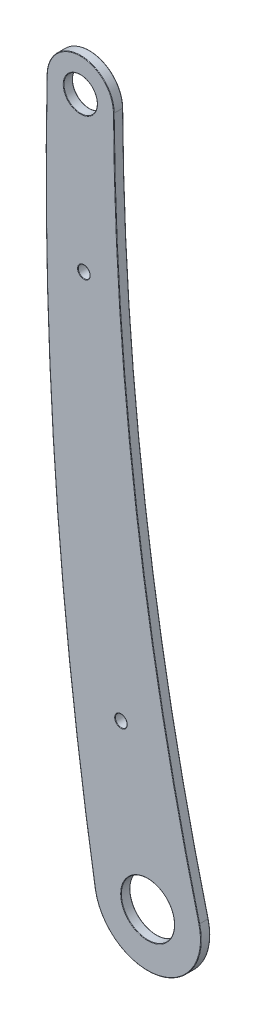
ISO-10303-21;
HEADER;
FILE_DESCRIPTION(('STEP AP214'),'2;1');
FILE_NAME('part.step','',(''),(''),'','','');
FILE_SCHEMA(('AUTOMOTIVE_DESIGN { 1 0 10303 214 1 1 1 1 }'));
ENDSEC;
DATA;
#1=APPLICATION_CONTEXT('core data for automotive mechanical design processes');
#2=APPLICATION_PROTOCOL_DEFINITION('international standard','automotive_design',2000,#1);
#3=PRODUCT_CONTEXT('',#1,'mechanical');
#4=PRODUCT('Part','Part','',(#3));
#5=PRODUCT_RELATED_PRODUCT_CATEGORY('part','',(#4));
#6=PRODUCT_DEFINITION_FORMATION('','',#4);
#7=PRODUCT_DEFINITION_CONTEXT('part definition',#1,'design');
#8=PRODUCT_DEFINITION('design','',#6,#7);
#9=PRODUCT_DEFINITION_SHAPE('','',#8);
#10=(LENGTH_UNIT() NAMED_UNIT(*) SI_UNIT(.MILLI.,.METRE.));
#11=(NAMED_UNIT(*) PLANE_ANGLE_UNIT() SI_UNIT($,.RADIAN.));
#12=(NAMED_UNIT(*) SI_UNIT($,.STERADIAN.) SOLID_ANGLE_UNIT());
#13=UNCERTAINTY_MEASURE_WITH_UNIT(LENGTH_MEASURE(1.E-05),#10,'distance_accuracy_value','');
#14=(GEOMETRIC_REPRESENTATION_CONTEXT(3) GLOBAL_UNCERTAINTY_ASSIGNED_CONTEXT((#13)) GLOBAL_UNIT_ASSIGNED_CONTEXT((#10,
#11,#12)) REPRESENTATION_CONTEXT('',''));
#15=CARTESIAN_POINT('',(0.,0.,0.));
#16=DIRECTION('',(0.,0.,1.));
#17=DIRECTION('',(1.,0.,0.));
#18=AXIS2_PLACEMENT_3D('',#15,#16,#17);
#19=CARTESIAN_POINT('',(-42.3309323896474,278.476144531453,-3.));
#20=DIRECTION('',(0.,0.,1.));
#21=DIRECTION('',(1.,0.,0.));
#22=AXIS2_PLACEMENT_3D('',#19,#20,#21);
#23=CYLINDRICAL_SURFACE('',#22,11.0000000000001);
#24=DIRECTION('',(0.,0.,1.));
#25=VECTOR('',#24,1.);
#26=CARTESIAN_POINT('',(-31.33121526042,278.555031013057,-3.));
#27=LINE('',#26,#25);
#28=CARTESIAN_POINT('',(-31.33121526042,278.555031013057,-2.85));
#29=VERTEX_POINT('',#28);
#30=CARTESIAN_POINT('',(-31.33121526042,278.555031013057,-0.15));
#31=VERTEX_POINT('',#30);
#32=EDGE_CURVE('E105',#29,#31,#27,.T.);
#33=ORIENTED_EDGE('',*,*,#32,.F.);
#34=CARTESIAN_POINT('',(-42.3309323896474,278.476144531453,-2.85));
#35=DIRECTION('',(0.,0.,-1.));
#36=DIRECTION('',(-1.,0.,0.));
#37=AXIS2_PLACEMENT_3D('',#34,#35,#36);
#38=CIRCLE('',#37,11.0000000000001);
#39=CARTESIAN_POINT('',(-53.3279977441943,278.730218512468,-2.85));
#40=VERTEX_POINT('',#39);
#41=EDGE_CURVE('E100',#29,#40,#38,.F.);
#42=ORIENTED_EDGE('',*,*,#41,.T.);
#43=DIRECTION('',(0.,0.,1.));
#44=VECTOR('',#43,1.);
#45=CARTESIAN_POINT('',(-53.3279977441943,278.730218512468,-3.));
#46=LINE('',#45,#44);
#47=CARTESIAN_POINT('',(-53.3279977441943,278.730218512468,-0.15));
#48=VERTEX_POINT('',#47);
#49=EDGE_CURVE('E102',#40,#48,#46,.T.);
#50=ORIENTED_EDGE('',*,*,#49,.T.);
#51=CARTESIAN_POINT('',(-42.3309323896474,278.476144531453,-0.15));
#52=DIRECTION('',(0.,0.,-1.));
#53=DIRECTION('',(-1.,0.,0.));
#54=AXIS2_PLACEMENT_3D('',#51,#52,#53);
#55=CIRCLE('',#54,11.0000000000001);
#56=EDGE_CURVE('E111',#48,#31,#55,.T.);
#57=ORIENTED_EDGE('',*,*,#56,.T.);
#58=EDGE_LOOP('',(#33,#42,#50,#57));
#59=FACE_BOUND('',#58,.T.);
#60=ADVANCED_FACE('F34',(#59),#23,.T.);
#61=CARTESIAN_POINT('',(868.645640767282,285.009379507946,-3.));
#62=DIRECTION('',(0.,0.,1.));
#63=DIRECTION('',(1.,0.,0.));
#64=AXIS2_PLACEMENT_3D('',#61,#62,#63);
#65=CYLINDRICAL_SURFACE('',#64,900.);
#66=DIRECTION('',(0.,0.,1.));
#67=VECTOR('',#66,1.);
#68=CARTESIAN_POINT('',(-3.26615944040631,61.9178900723588,-3.));
#69=LINE('',#68,#67);
#70=CARTESIAN_POINT('',(-3.26615944040631,61.9178900723588,-2.85));
#71=VERTEX_POINT('',#70);
#72=CARTESIAN_POINT('',(-3.26615944040631,61.9178900723588,-0.15));
#73=VERTEX_POINT('',#72);
#74=EDGE_CURVE('E235',#71,#73,#69,.T.);
#75=ORIENTED_EDGE('',*,*,#74,.F.);
#76=CARTESIAN_POINT('',(868.645640767282,285.009379507946,-2.85));
#77=DIRECTION('',(0.,0.,-1.));
#78=DIRECTION('',(-1.,0.,0.));
#79=AXIS2_PLACEMENT_3D('',#76,#77,#78);
#80=CIRCLE('',#79,900.);
#81=EDGE_CURVE('E167',#71,#29,#80,.T.);
#82=ORIENTED_EDGE('',*,*,#81,.T.);
#83=ORIENTED_EDGE('',*,*,#32,.T.);
#84=CARTESIAN_POINT('',(868.645640767282,285.009379507946,-0.15));
#85=DIRECTION('',(0.,0.,-1.));
#86=DIRECTION('',(-1.,0.,0.));
#87=AXIS2_PLACEMENT_3D('',#84,#85,#86);
#88=CIRCLE('',#87,900.);
#89=EDGE_CURVE('E164',#31,#73,#88,.F.);
#90=ORIENTED_EDGE('',*,*,#89,.T.);
#91=EDGE_LOOP('',(#75,#82,#83,#90));
#92=FACE_BOUND('',#91,.T.);
#93=ADVANCED_FACE('F232',(#92),#65,.F.);
#94=CARTESIAN_POINT('',(-20.2199999999997,57.58,-3.));
#95=DIRECTION('',(0.,0.,1.));
#96=DIRECTION('',(1.,0.,0.));
#97=AXIS2_PLACEMENT_3D('',#94,#95,#96);
#98=CYLINDRICAL_SURFACE('',#97,17.4999999999997);
#99=DIRECTION('',(0.,0.,1.));
#100=VECTOR('',#99,1.);
#101=CARTESIAN_POINT('',(-37.4842769847946,54.7173543369338,-3.));
#102=LINE('',#101,#100);
#103=CARTESIAN_POINT('',(-37.4842769847946,54.7173543369338,-2.85));
#104=VERTEX_POINT('',#103);
#105=CARTESIAN_POINT('',(-37.4842769847946,54.7173543369338,-0.15));
#106=VERTEX_POINT('',#105);
#107=EDGE_CURVE('E122',#104,#106,#102,.T.);
#108=ORIENTED_EDGE('',*,*,#107,.F.);
#109=CARTESIAN_POINT('',(-20.2199999999997,57.58,-2.85));
#110=DIRECTION('',(0.,0.,-1.));
#111=DIRECTION('',(-1.,0.,0.));
#112=AXIS2_PLACEMENT_3D('',#109,#110,#111);
#113=CIRCLE('',#112,17.4999999999997);
#114=EDGE_CURVE('E162',#104,#71,#113,.F.);
#115=ORIENTED_EDGE('',*,*,#114,.T.);
#116=ORIENTED_EDGE('',*,*,#74,.T.);
#117=CARTESIAN_POINT('',(-20.2199999999997,57.58,-0.15));
#118=DIRECTION('',(0.,0.,-1.));
#119=DIRECTION('',(-1.,0.,0.));
#120=AXIS2_PLACEMENT_3D('',#117,#118,#119);
#121=CIRCLE('',#120,17.4999999999997);
#122=EDGE_CURVE('E160',#73,#106,#121,.T.);
#123=ORIENTED_EDGE('',*,*,#122,.T.);
#124=EDGE_LOOP('',(#108,#115,#116,#123));
#125=FACE_BOUND('',#124,.T.);
#126=ADVANCED_FACE('F279',(#125),#98,.T.);
#127=CARTESIAN_POINT('',(1146.35185911544,251.013056947191,-3.));
#128=DIRECTION('',(0.,0.,1.));
#129=DIRECTION('',(1.,0.,0.));
#130=AXIS2_PLACEMENT_3D('',#127,#128,#129);
#131=CYLINDRICAL_SURFACE('',#130,1200.);
#132=ORIENTED_EDGE('',*,*,#49,.F.);
#133=CARTESIAN_POINT('',(1146.35185911544,251.013056947191,-2.85));
#134=DIRECTION('',(0.,0.,-1.));
#135=DIRECTION('',(-1.,0.,0.));
#136=AXIS2_PLACEMENT_3D('',#133,#134,#135);
#137=CIRCLE('',#136,1200.);
#138=EDGE_CURVE('E118',#40,#104,#137,.F.);
#139=ORIENTED_EDGE('',*,*,#138,.T.);
#140=ORIENTED_EDGE('',*,*,#107,.T.);
#141=CARTESIAN_POINT('',(1146.35185911544,251.013056947191,-0.15));
#142=DIRECTION('',(0.,0.,-1.));
#143=DIRECTION('',(-1.,0.,0.));
#144=AXIS2_PLACEMENT_3D('',#141,#142,#143);
#145=CIRCLE('',#144,1200.);
#146=EDGE_CURVE('E121',#106,#48,#145,.T.);
#147=ORIENTED_EDGE('',*,*,#146,.T.);
#148=EDGE_LOOP('',(#132,#139,#140,#147));
#149=FACE_BOUND('',#148,.T.);
#150=ADVANCED_FACE('F115',(#149),#131,.T.);
#151=CARTESIAN_POINT('',(413.157354188817,281.7427620197,-3.));
#152=DIRECTION('',(0.,0.,-1.));
#153=DIRECTION('',(-1.,0.,0.));
#154=AXIS2_PLACEMENT_3D('',#151,#152,#153);
#155=PLANE('',#154);
#156=CARTESIAN_POINT('',(-20.2199999999997,57.58,-3.));
#157=DIRECTION('',(0.,0.,-1.));
#158=DIRECTION('',(-1.,0.,0.));
#159=AXIS2_PLACEMENT_3D('',#156,#157,#158);
#160=CIRCLE('',#159,17.3499999999997);
#161=CARTESIAN_POINT('',(-3.41147807377414,61.8807081574529,-3.));
#162=VERTEX_POINT('',#161);
#163=CARTESIAN_POINT('',(-37.336297467782,54.7418912997601,-3.));
#164=VERTEX_POINT('',#163);
#165=EDGE_CURVE('E156',#162,#164,#160,.T.);
#166=ORIENTED_EDGE('',*,*,#165,.T.);
#167=CARTESIAN_POINT('',(1146.35185911544,251.013056947191,-3.));
#168=DIRECTION('',(0.,0.,-1.));
#169=DIRECTION('',(-1.,0.,0.));
#170=AXIS2_PLACEMENT_3D('',#167,#168,#169);
#171=CIRCLE('',#170,1199.85);
#172=CARTESIAN_POINT('',(-53.1780377620867,278.726753867272,-3.));
#173=VERTEX_POINT('',#172);
#174=EDGE_CURVE('E158',#164,#173,#171,.T.);
#175=ORIENTED_EDGE('',*,*,#174,.T.);
#176=CARTESIAN_POINT('',(-42.3309323896474,278.476144531453,-3.));
#177=DIRECTION('',(0.,0.,-1.));
#178=DIRECTION('',(-1.,0.,0.));
#179=AXIS2_PLACEMENT_3D('',#176,#177,#178);
#180=CIRCLE('',#179,10.8500000000001);
#181=CARTESIAN_POINT('',(-31.481211403091,278.553955288308,-3.));
#182=VERTEX_POINT('',#181);
#183=EDGE_CURVE('E128',#173,#182,#180,.T.);
#184=ORIENTED_EDGE('',*,*,#183,.T.);
#185=CARTESIAN_POINT('',(868.645640767282,285.009379507946,-3.));
#186=DIRECTION('',(0.,0.,-1.));
#187=DIRECTION('',(-1.,0.,0.));
#188=AXIS2_PLACEMENT_3D('',#185,#186,#187);
#189=CIRCLE('',#188,900.15);
#190=EDGE_CURVE('E154',#182,#162,#189,.F.);
#191=ORIENTED_EDGE('',*,*,#190,.T.);
#192=EDGE_LOOP('',(#166,#175,#184,#191));
#193=FACE_BOUND('',#192,.T.);
#194=CARTESIAN_POINT('',(-20.2199999999997,57.58,-3.));
#195=DIRECTION('',(0.,0.,-1.));
#196=DIRECTION('',(-1.,0.,0.));
#197=AXIS2_PLACEMENT_3D('',#194,#195,#196);
#198=CIRCLE('',#197,8.9);
#199=CARTESIAN_POINT('',(-29.1199999999997,57.58,-3.));
#200=VERTEX_POINT('',#199);
#201=EDGE_CURVE('E150',#200,#200,#198,.F.);
#202=ORIENTED_EDGE('',*,*,#201,.T.);
#203=EDGE_LOOP('',(#202));
#204=FACE_BOUND('',#203,.T.);
#205=CARTESIAN_POINT('',(-42.3309323896474,278.476144531453,-3.));
#206=DIRECTION('',(0.,0.,-1.));
#207=DIRECTION('',(-1.,0.,0.));
#208=AXIS2_PLACEMENT_3D('',#205,#206,#207);
#209=CIRCLE('',#208,5.65);
#210=CARTESIAN_POINT('',(-47.9809323896473,278.476144531453,-3.));
#211=VERTEX_POINT('',#210);
#212=EDGE_CURVE('E147',#211,#211,#209,.F.);
#213=ORIENTED_EDGE('',*,*,#212,.T.);
#214=EDGE_LOOP('',(#213));
#215=FACE_BOUND('',#214,.T.);
#216=CARTESIAN_POINT('',(-28.9927348903585,106.804375288504,-3.));
#217=DIRECTION('',(0.,0.,-1.));
#218=DIRECTION('',(-1.,0.,0.));
#219=AXIS2_PLACEMENT_3D('',#216,#217,#218);
#220=CIRCLE('',#219,2.1);
#221=CARTESIAN_POINT('',(-31.0927348903585,106.804375288504,-3.));
#222=VERTEX_POINT('',#221);
#223=EDGE_CURVE('E141',#222,#222,#220,.F.);
#224=ORIENTED_EDGE('',*,*,#223,.T.);
#225=EDGE_LOOP('',(#224));
#226=FACE_BOUND('',#225,.T.);
#227=CARTESIAN_POINT('',(-41.1729962338893,228.489554491131,-3.));
#228=DIRECTION('',(0.,0.,-1.));
#229=DIRECTION('',(-1.,0.,0.));
#230=AXIS2_PLACEMENT_3D('',#227,#228,#229);
#231=CIRCLE('',#230,2.1);
#232=CARTESIAN_POINT('',(-43.2729962338893,228.489554491131,-3.));
#233=VERTEX_POINT('',#232);
#234=EDGE_CURVE('E138',#233,#233,#231,.F.);
#235=ORIENTED_EDGE('',*,*,#234,.T.);
#236=EDGE_LOOP('',(#235));
#237=FACE_BOUND('',#236,.T.);
#238=ADVANCED_FACE('F244',(#193,#204,#215,#226,#237),#155,.T.);
#239=CARTESIAN_POINT('',(413.157354188817,281.7427620197,0.));
#240=DIRECTION('',(0.,0.,-1.));
#241=DIRECTION('',(-1.,0.,0.));
#242=AXIS2_PLACEMENT_3D('',#239,#240,#241);
#243=PLANE('',#242);
#244=CARTESIAN_POINT('',(-20.2199999999997,57.58,0.));
#245=DIRECTION('',(0.,0.,-1.));
#246=DIRECTION('',(-1.,0.,0.));
#247=AXIS2_PLACEMENT_3D('',#244,#245,#246);
#248=CIRCLE('',#247,17.3499999999997);
#249=CARTESIAN_POINT('',(-37.3362974677822,54.74189129976,0.));
#250=VERTEX_POINT('',#249);
#251=CARTESIAN_POINT('',(-3.41147807377414,61.8807081574529,0.));
#252=VERTEX_POINT('',#251);
#253=EDGE_CURVE('E43',#250,#252,#248,.F.);
#254=ORIENTED_EDGE('',*,*,#253,.T.);
#255=CARTESIAN_POINT('',(868.645640767282,285.009379507946,0.));
#256=DIRECTION('',(0.,0.,-1.));
#257=DIRECTION('',(-1.,0.,0.));
#258=AXIS2_PLACEMENT_3D('',#255,#256,#257);
#259=CIRCLE('',#258,900.15);
#260=CARTESIAN_POINT('',(-31.481211403091,278.553955288308,0.));
#261=VERTEX_POINT('',#260);
#262=EDGE_CURVE('E11',#252,#261,#259,.T.);
#263=ORIENTED_EDGE('',*,*,#262,.T.);
#264=CARTESIAN_POINT('',(-42.3309323896474,278.476144531453,0.));
#265=DIRECTION('',(0.,0.,-1.));
#266=DIRECTION('',(-1.,0.,0.));
#267=AXIS2_PLACEMENT_3D('',#264,#265,#266);
#268=CIRCLE('',#267,10.8500000000001);
#269=CARTESIAN_POINT('',(-53.1780377620867,278.726753867272,0.));
#270=VERTEX_POINT('',#269);
#271=EDGE_CURVE('E205',#261,#270,#268,.F.);
#272=ORIENTED_EDGE('',*,*,#271,.T.);
#273=CARTESIAN_POINT('',(1146.35185911544,251.013056947191,0.));
#274=DIRECTION('',(0.,0.,-1.));
#275=DIRECTION('',(-1.,0.,0.));
#276=AXIS2_PLACEMENT_3D('',#273,#274,#275);
#277=CIRCLE('',#276,1199.85);
#278=EDGE_CURVE('E54',#270,#250,#277,.F.);
#279=ORIENTED_EDGE('',*,*,#278,.T.);
#280=EDGE_LOOP('',(#254,#263,#272,#279));
#281=FACE_BOUND('',#280,.T.);
#282=CARTESIAN_POINT('',(-20.2199999999997,57.58,0.));
#283=DIRECTION('',(0.,0.,-1.));
#284=DIRECTION('',(-1.,0.,0.));
#285=AXIS2_PLACEMENT_3D('',#282,#283,#284);
#286=CIRCLE('',#285,8.9);
#287=CARTESIAN_POINT('',(-29.1199999999997,57.58,0.));
#288=VERTEX_POINT('',#287);
#289=EDGE_CURVE('E202',#288,#288,#286,.T.);
#290=ORIENTED_EDGE('',*,*,#289,.T.);
#291=EDGE_LOOP('',(#290));
#292=FACE_BOUND('',#291,.T.);
#293=CARTESIAN_POINT('',(-42.3309323896474,278.476144531453,0.));
#294=DIRECTION('',(0.,0.,-1.));
#295=DIRECTION('',(-1.,0.,0.));
#296=AXIS2_PLACEMENT_3D('',#293,#294,#295);
#297=CIRCLE('',#296,5.65);
#298=CARTESIAN_POINT('',(-47.9809323896473,278.476144531453,0.));
#299=VERTEX_POINT('',#298);
#300=EDGE_CURVE('E199',#299,#299,#297,.T.);
#301=ORIENTED_EDGE('',*,*,#300,.T.);
#302=EDGE_LOOP('',(#301));
#303=FACE_BOUND('',#302,.T.);
#304=CARTESIAN_POINT('',(-28.9927348903585,106.804375288504,0.));
#305=DIRECTION('',(0.,0.,-1.));
#306=DIRECTION('',(-1.,0.,0.));
#307=AXIS2_PLACEMENT_3D('',#304,#305,#306);
#308=CIRCLE('',#307,2.1);
#309=CARTESIAN_POINT('',(-31.0927348903585,106.804375288504,0.));
#310=VERTEX_POINT('',#309);
#311=EDGE_CURVE('E196',#310,#310,#308,.T.);
#312=ORIENTED_EDGE('',*,*,#311,.T.);
#313=EDGE_LOOP('',(#312));
#314=FACE_BOUND('',#313,.T.);
#315=CARTESIAN_POINT('',(-41.1729962338893,228.489554491131,0.));
#316=DIRECTION('',(0.,0.,-1.));
#317=DIRECTION('',(-1.,0.,0.));
#318=AXIS2_PLACEMENT_3D('',#315,#316,#317);
#319=CIRCLE('',#318,2.1);
#320=CARTESIAN_POINT('',(-43.2729962338893,228.489554491131,0.));
#321=VERTEX_POINT('',#320);
#322=EDGE_CURVE('E193',#321,#321,#319,.T.);
#323=ORIENTED_EDGE('',*,*,#322,.T.);
#324=EDGE_LOOP('',(#323));
#325=FACE_BOUND('',#324,.T.);
#326=ADVANCED_FACE('F240',(#281,#292,#303,#314,#325),#243,.F.);
#327=CARTESIAN_POINT('',(-20.2199999999997,57.58,-3.));
#328=DIRECTION('',(0.,0.,1.));
#329=DIRECTION('',(1.,0.,0.));
#330=AXIS2_PLACEMENT_3D('',#327,#328,#329);
#331=CYLINDRICAL_SURFACE('',#330,8.75);
#332=CARTESIAN_POINT('',(-20.2199999999997,57.58,-2.85));
#333=DIRECTION('',(0.,0.,-1.));
#334=DIRECTION('',(-1.,0.,0.));
#335=AXIS2_PLACEMENT_3D('',#332,#333,#334);
#336=CIRCLE('',#335,8.75);
#337=CARTESIAN_POINT('',(-28.9699999999997,57.58,-2.85));
#338=VERTEX_POINT('',#337);
#339=EDGE_CURVE('E172',#338,#338,#336,.T.);
#340=ORIENTED_EDGE('',*,*,#339,.T.);
#341=EDGE_LOOP('',(#340));
#342=FACE_BOUND('',#341,.T.);
#343=CARTESIAN_POINT('',(-20.2199999999997,57.58,-0.15));
#344=DIRECTION('',(0.,0.,-1.));
#345=DIRECTION('',(-1.,0.,0.));
#346=AXIS2_PLACEMENT_3D('',#343,#344,#345);
#347=CIRCLE('',#346,8.75);
#348=CARTESIAN_POINT('',(-28.9699999999997,57.58,-0.15));
#349=VERTEX_POINT('',#348);
#350=EDGE_CURVE('E110',#349,#349,#347,.F.);
#351=ORIENTED_EDGE('',*,*,#350,.T.);
#352=EDGE_LOOP('',(#351));
#353=FACE_BOUND('',#352,.T.);
#354=ADVANCED_FACE('F243',(#342,#353),#331,.F.);
#355=CARTESIAN_POINT('',(-42.3309323896474,278.476144531453,-3.));
#356=DIRECTION('',(0.,0.,1.));
#357=DIRECTION('',(1.,0.,0.));
#358=AXIS2_PLACEMENT_3D('',#355,#356,#357);
#359=CYLINDRICAL_SURFACE('',#358,5.5);
#360=CARTESIAN_POINT('',(-42.3309323896474,278.476144531453,-2.85));
#361=DIRECTION('',(0.,0.,-1.));
#362=DIRECTION('',(-1.,0.,0.));
#363=AXIS2_PLACEMENT_3D('',#360,#361,#362);
#364=CIRCLE('',#363,5.5);
#365=CARTESIAN_POINT('',(-47.8309323896474,278.476144531453,-2.85));
#366=VERTEX_POINT('',#365);
#367=EDGE_CURVE('E178',#366,#366,#364,.T.);
#368=ORIENTED_EDGE('',*,*,#367,.T.);
#369=EDGE_LOOP('',(#368));
#370=FACE_BOUND('',#369,.T.);
#371=CARTESIAN_POINT('',(-42.3309323896474,278.476144531453,-0.15));
#372=DIRECTION('',(0.,0.,-1.));
#373=DIRECTION('',(-1.,0.,0.));
#374=AXIS2_PLACEMENT_3D('',#371,#372,#373);
#375=CIRCLE('',#374,5.5);
#376=CARTESIAN_POINT('',(-47.8309323896474,278.476144531453,-0.15));
#377=VERTEX_POINT('',#376);
#378=EDGE_CURVE('E175',#377,#377,#375,.F.);
#379=ORIENTED_EDGE('',*,*,#378,.T.);
#380=EDGE_LOOP('',(#379));
#381=FACE_BOUND('',#380,.T.);
#382=ADVANCED_FACE('F271',(#370,#381),#359,.F.);
#383=CARTESIAN_POINT('',(-28.9927348903585,106.804375288504,-3.));
#384=DIRECTION('',(0.,0.,1.));
#385=DIRECTION('',(1.,0.,0.));
#386=AXIS2_PLACEMENT_3D('',#383,#384,#385);
#387=CYLINDRICAL_SURFACE('',#386,1.95);
#388=CARTESIAN_POINT('',(-28.9927348903585,106.804375288504,-2.85));
#389=DIRECTION('',(0.,0.,-1.));
#390=DIRECTION('',(-1.,0.,0.));
#391=AXIS2_PLACEMENT_3D('',#388,#389,#390);
#392=CIRCLE('',#391,1.95);
#393=CARTESIAN_POINT('',(-30.9427348903585,106.804375288504,-2.85));
#394=VERTEX_POINT('',#393);
#395=EDGE_CURVE('E184',#394,#394,#392,.T.);
#396=ORIENTED_EDGE('',*,*,#395,.T.);
#397=EDGE_LOOP('',(#396));
#398=FACE_BOUND('',#397,.T.);
#399=CARTESIAN_POINT('',(-28.9927348903585,106.804375288504,-0.15));
#400=DIRECTION('',(0.,0.,-1.));
#401=DIRECTION('',(-1.,0.,0.));
#402=AXIS2_PLACEMENT_3D('',#399,#400,#401);
#403=CIRCLE('',#402,1.95);
#404=CARTESIAN_POINT('',(-30.9427348903585,106.804375288504,-0.15));
#405=VERTEX_POINT('',#404);
#406=EDGE_CURVE('E181',#405,#405,#403,.F.);
#407=ORIENTED_EDGE('',*,*,#406,.T.);
#408=EDGE_LOOP('',(#407));
#409=FACE_BOUND('',#408,.T.);
#410=ADVANCED_FACE('F262',(#398,#409),#387,.F.);
#411=CARTESIAN_POINT('',(-41.1729962338893,228.489554491131,-3.));
#412=DIRECTION('',(0.,0.,1.));
#413=DIRECTION('',(1.,0.,0.));
#414=AXIS2_PLACEMENT_3D('',#411,#412,#413);
#415=CYLINDRICAL_SURFACE('',#414,1.95);
#416=CARTESIAN_POINT('',(-41.1729962338893,228.489554491131,-2.85));
#417=DIRECTION('',(0.,0.,-1.));
#418=DIRECTION('',(-1.,0.,0.));
#419=AXIS2_PLACEMENT_3D('',#416,#417,#418);
#420=CIRCLE('',#419,1.95);
#421=CARTESIAN_POINT('',(-43.1229962338893,228.489554491131,-2.85));
#422=VERTEX_POINT('',#421);
#423=EDGE_CURVE('E190',#422,#422,#420,.T.);
#424=ORIENTED_EDGE('',*,*,#423,.T.);
#425=EDGE_LOOP('',(#424));
#426=FACE_BOUND('',#425,.T.);
#427=CARTESIAN_POINT('',(-41.1729962338893,228.489554491131,-0.15));
#428=DIRECTION('',(0.,0.,-1.));
#429=DIRECTION('',(-1.,0.,0.));
#430=AXIS2_PLACEMENT_3D('',#427,#428,#429);
#431=CIRCLE('',#430,1.95);
#432=CARTESIAN_POINT('',(-43.1229962338893,228.489554491131,-0.15));
#433=VERTEX_POINT('',#432);
#434=EDGE_CURVE('E187',#433,#433,#431,.F.);
#435=ORIENTED_EDGE('',*,*,#434,.T.);
#436=EDGE_LOOP('',(#435));
#437=FACE_BOUND('',#436,.T.);
#438=ADVANCED_FACE('F259',(#426,#437),#415,.F.);
#439=CARTESIAN_POINT('',(868.645640767282,285.009379507946,-2.85));
#440=DIRECTION('',(0.,0.,-1.));
#441=DIRECTION('',(-1.,0.,0.));
#442=AXIS2_PLACEMENT_3D('',#439,#440,#441);
#443=TOROIDAL_SURFACE('',#442,900.15,0.15);
#444=CARTESIAN_POINT('',(-3.41147807377414,61.8807081574529,-2.85));
#445=DIRECTION('',(0.24787943270622,-0.96879088911965,0.));
#446=DIRECTION('',(0.96879088911965,0.24787943270622,0.));
#447=AXIS2_PLACEMENT_3D('',#444,#445,#446);
#448=CIRCLE('',#447,0.15);
#449=EDGE_CURVE('E132',#162,#71,#448,.T.);
#450=ORIENTED_EDGE('',*,*,#449,.F.);
#451=ORIENTED_EDGE('',*,*,#190,.F.);
#452=CARTESIAN_POINT('',(-31.4812114030913,278.553955288308,-2.85));
#453=DIRECTION('',(-0.00717149832777743,0.999974284475223,0.));
#454=DIRECTION('',(-0.999974284475223,-0.00717149832777743,0.));
#455=AXIS2_PLACEMENT_3D('',#452,#453,#454);
#456=CIRCLE('',#455,0.15);
#457=EDGE_CURVE('E123',#29,#182,#456,.T.);
#458=ORIENTED_EDGE('',*,*,#457,.F.);
#459=ORIENTED_EDGE('',*,*,#81,.F.);
#460=EDGE_LOOP('',(#450,#451,#458,#459));
#461=FACE_BOUND('',#460,.T.);
#462=ADVANCED_FACE('F261',(#461),#443,.T.);
#463=CARTESIAN_POINT('',(-42.3309323896474,278.476144531453,-2.85));
#464=DIRECTION('',(0.,0.,-1.));
#465=DIRECTION('',(-1.,0.,0.));
#466=AXIS2_PLACEMENT_3D('',#463,#464,#465);
#467=TOROIDAL_SURFACE('',#466,10.8500000000001,0.15);
#468=ORIENTED_EDGE('',*,*,#457,.T.);
#469=ORIENTED_EDGE('',*,*,#183,.F.);
#470=CARTESIAN_POINT('',(-53.1780377620867,278.726753867272,-2.85));
#471=DIRECTION('',(-0.023097634637888,-0.999733214049696,0.));
#472=DIRECTION('',(0.999733214049696,-0.023097634637888,0.));
#473=AXIS2_PLACEMENT_3D('',#470,#471,#472);
#474=CIRCLE('',#473,0.15);
#475=EDGE_CURVE('E126',#40,#173,#474,.T.);
#476=ORIENTED_EDGE('',*,*,#475,.F.);
#477=ORIENTED_EDGE('',*,*,#41,.F.);
#478=EDGE_LOOP('',(#468,#469,#476,#477));
#479=FACE_BOUND('',#478,.T.);
#480=ADVANCED_FACE('F127',(#479),#467,.T.);
#481=CARTESIAN_POINT('',(-20.2199999999997,57.58,-2.85));
#482=DIRECTION('',(0.,0.,-1.));
#483=DIRECTION('',(-1.,0.,0.));
#484=AXIS2_PLACEMENT_3D('',#481,#482,#483);
#485=TOROIDAL_SURFACE('',#484,17.3499999999997,0.15);
#486=ORIENTED_EDGE('',*,*,#449,.T.);
#487=ORIENTED_EDGE('',*,*,#114,.F.);
#488=CARTESIAN_POINT('',(-37.336297467782,54.7418912997601,-2.85));
#489=DIRECTION('',(-0.163579752175218,0.986530113416866,0.));
#490=DIRECTION('',(-0.986530113416866,-0.163579752175218,0.));
#491=AXIS2_PLACEMENT_3D('',#488,#489,#490);
#492=CIRCLE('',#491,0.15);
#493=EDGE_CURVE('E133',#164,#104,#492,.T.);
#494=ORIENTED_EDGE('',*,*,#493,.F.);
#495=ORIENTED_EDGE('',*,*,#165,.F.);
#496=EDGE_LOOP('',(#486,#487,#494,#495));
#497=FACE_BOUND('',#496,.T.);
#498=ADVANCED_FACE('F287',(#497),#485,.T.);
#499=CARTESIAN_POINT('',(1146.35185911544,251.013056947191,-2.85));
#500=DIRECTION('',(0.,0.,-1.));
#501=DIRECTION('',(-1.,0.,0.));
#502=AXIS2_PLACEMENT_3D('',#499,#500,#501);
#503=TOROIDAL_SURFACE('',#502,1199.85,0.15);
#504=ORIENTED_EDGE('',*,*,#475,.T.);
#505=ORIENTED_EDGE('',*,*,#174,.F.);
#506=ORIENTED_EDGE('',*,*,#493,.T.);
#507=ORIENTED_EDGE('',*,*,#138,.F.);
#508=EDGE_LOOP('',(#504,#505,#506,#507));
#509=FACE_BOUND('',#508,.T.);
#510=ADVANCED_FACE('F135',(#509),#503,.T.);
#511=CARTESIAN_POINT('',(-20.2199999999997,57.58,-2.85));
#512=DIRECTION('',(0.,0.,-1.));
#513=DIRECTION('',(-1.,0.,0.));
#514=AXIS2_PLACEMENT_3D('',#511,#512,#513);
#515=TOROIDAL_SURFACE('',#514,8.9,0.15);
#516=ORIENTED_EDGE('',*,*,#339,.F.);
#517=EDGE_LOOP('',(#516));
#518=FACE_BOUND('',#517,.T.);
#519=ORIENTED_EDGE('',*,*,#201,.F.);
#520=EDGE_LOOP('',(#519));
#521=FACE_BOUND('',#520,.T.);
#522=ADVANCED_FACE('F286',(#518,#521),#515,.T.);
#523=CARTESIAN_POINT('',(-42.3309323896474,278.476144531453,-2.85));
#524=DIRECTION('',(0.,0.,-1.));
#525=DIRECTION('',(-1.,0.,0.));
#526=AXIS2_PLACEMENT_3D('',#523,#524,#525);
#527=TOROIDAL_SURFACE('',#526,5.65,0.15);
#528=ORIENTED_EDGE('',*,*,#367,.F.);
#529=EDGE_LOOP('',(#528));
#530=FACE_BOUND('',#529,.T.);
#531=ORIENTED_EDGE('',*,*,#212,.F.);
#532=EDGE_LOOP('',(#531));
#533=FACE_BOUND('',#532,.T.);
#534=ADVANCED_FACE('F295',(#530,#533),#527,.T.);
#535=CARTESIAN_POINT('',(-28.9927348903585,106.804375288504,-2.85));
#536=DIRECTION('',(0.,0.,-1.));
#537=DIRECTION('',(-1.,0.,0.));
#538=AXIS2_PLACEMENT_3D('',#535,#536,#537);
#539=TOROIDAL_SURFACE('',#538,2.1,0.15);
#540=ORIENTED_EDGE('',*,*,#395,.F.);
#541=EDGE_LOOP('',(#540));
#542=FACE_BOUND('',#541,.T.);
#543=ORIENTED_EDGE('',*,*,#223,.F.);
#544=EDGE_LOOP('',(#543));
#545=FACE_BOUND('',#544,.T.);
#546=ADVANCED_FACE('F299',(#542,#545),#539,.T.);
#547=CARTESIAN_POINT('',(-41.1729962338893,228.489554491131,-2.85));
#548=DIRECTION('',(0.,0.,-1.));
#549=DIRECTION('',(-1.,0.,0.));
#550=AXIS2_PLACEMENT_3D('',#547,#548,#549);
#551=TOROIDAL_SURFACE('',#550,2.1,0.15);
#552=ORIENTED_EDGE('',*,*,#423,.F.);
#553=EDGE_LOOP('',(#552));
#554=FACE_BOUND('',#553,.T.);
#555=ORIENTED_EDGE('',*,*,#234,.F.);
#556=EDGE_LOOP('',(#555));
#557=FACE_BOUND('',#556,.T.);
#558=ADVANCED_FACE('F303',(#554,#557),#551,.T.);
#559=CARTESIAN_POINT('',(1146.35185911544,251.013056947191,-0.15));
#560=DIRECTION('',(0.,0.,-1.));
#561=DIRECTION('',(-1.,0.,0.));
#562=AXIS2_PLACEMENT_3D('',#559,#560,#561);
#563=TOROIDAL_SURFACE('',#562,1199.85,0.15);
#564=CARTESIAN_POINT('',(-53.1780377620868,278.726753867272,-0.15));
#565=DIRECTION('',(0.023097634637888,0.999733214049696,0.));
#566=DIRECTION('',(-0.999733214049696,0.023097634637888,0.));
#567=AXIS2_PLACEMENT_3D('',#564,#565,#566);
#568=CIRCLE('',#567,0.15);
#569=EDGE_CURVE('E216',#48,#270,#568,.T.);
#570=ORIENTED_EDGE('',*,*,#569,.F.);
#571=ORIENTED_EDGE('',*,*,#146,.F.);
#572=CARTESIAN_POINT('',(-37.3362974677822,54.74189129976,-0.15));
#573=DIRECTION('',(0.163579752175218,-0.986530113416866,0.));
#574=DIRECTION('',(0.986530113416866,0.163579752175218,0.));
#575=AXIS2_PLACEMENT_3D('',#572,#573,#574);
#576=CIRCLE('',#575,0.15);
#577=EDGE_CURVE('E38',#250,#106,#576,.T.);
#578=ORIENTED_EDGE('',*,*,#577,.F.);
#579=ORIENTED_EDGE('',*,*,#278,.F.);
#580=EDGE_LOOP('',(#570,#571,#578,#579));
#581=FACE_BOUND('',#580,.T.);
#582=ADVANCED_FACE('F226',(#581),#563,.T.);
#583=CARTESIAN_POINT('',(-20.2199999999997,57.58,-0.15));
#584=DIRECTION('',(0.,0.,-1.));
#585=DIRECTION('',(-1.,0.,0.));
#586=AXIS2_PLACEMENT_3D('',#583,#584,#585);
#587=TOROIDAL_SURFACE('',#586,17.3499999999997,0.15);
#588=ORIENTED_EDGE('',*,*,#577,.T.);
#589=ORIENTED_EDGE('',*,*,#122,.F.);
#590=CARTESIAN_POINT('',(-3.41147807377414,61.8807081574529,-0.15));
#591=DIRECTION('',(-0.247879432706219,0.968790889119651,0.));
#592=DIRECTION('',(-0.968790889119651,-0.247879432706219,0.));
#593=AXIS2_PLACEMENT_3D('',#590,#591,#592);
#594=CIRCLE('',#593,0.15);
#595=EDGE_CURVE('E215',#252,#73,#594,.T.);
#596=ORIENTED_EDGE('',*,*,#595,.F.);
#597=ORIENTED_EDGE('',*,*,#253,.F.);
#598=EDGE_LOOP('',(#588,#589,#596,#597));
#599=FACE_BOUND('',#598,.T.);
#600=ADVANCED_FACE('F224',(#599),#587,.T.);
#601=CARTESIAN_POINT('',(-42.3309323896474,278.476144531453,-0.15));
#602=DIRECTION('',(0.,0.,-1.));
#603=DIRECTION('',(-1.,0.,0.));
#604=AXIS2_PLACEMENT_3D('',#601,#602,#603);
#605=TOROIDAL_SURFACE('',#604,10.8500000000001,0.15);
#606=ORIENTED_EDGE('',*,*,#569,.T.);
#607=ORIENTED_EDGE('',*,*,#271,.F.);
#608=CARTESIAN_POINT('',(-31.481211403091,278.553955288308,-0.15));
#609=DIRECTION('',(0.00717149832777743,-0.999974284475223,0.));
#610=DIRECTION('',(0.999974284475223,0.00717149832777743,0.));
#611=AXIS2_PLACEMENT_3D('',#608,#609,#610);
#612=CIRCLE('',#611,0.15);
#613=EDGE_CURVE('E213',#31,#261,#612,.T.);
#614=ORIENTED_EDGE('',*,*,#613,.F.);
#615=ORIENTED_EDGE('',*,*,#56,.F.);
#616=EDGE_LOOP('',(#606,#607,#614,#615));
#617=FACE_BOUND('',#616,.T.);
#618=ADVANCED_FACE('F228',(#617),#605,.T.);
#619=CARTESIAN_POINT('',(868.645640767282,285.009379507946,-0.15));
#620=DIRECTION('',(0.,0.,-1.));
#621=DIRECTION('',(-1.,0.,0.));
#622=AXIS2_PLACEMENT_3D('',#619,#620,#621);
#623=TOROIDAL_SURFACE('',#622,900.15,0.15);
#624=ORIENTED_EDGE('',*,*,#595,.T.);
#625=ORIENTED_EDGE('',*,*,#89,.F.);
#626=ORIENTED_EDGE('',*,*,#613,.T.);
#627=ORIENTED_EDGE('',*,*,#262,.F.);
#628=EDGE_LOOP('',(#624,#625,#626,#627));
#629=FACE_BOUND('',#628,.T.);
#630=ADVANCED_FACE('F238',(#629),#623,.T.);
#631=CARTESIAN_POINT('',(-20.2199999999997,57.58,-0.15));
#632=DIRECTION('',(0.,0.,-1.));
#633=DIRECTION('',(-1.,0.,0.));
#634=AXIS2_PLACEMENT_3D('',#631,#632,#633);
#635=TOROIDAL_SURFACE('',#634,8.9,0.15);
#636=ORIENTED_EDGE('',*,*,#289,.F.);
#637=EDGE_LOOP('',(#636));
#638=FACE_BOUND('',#637,.T.);
#639=ORIENTED_EDGE('',*,*,#350,.F.);
#640=EDGE_LOOP('',(#639));
#641=FACE_BOUND('',#640,.T.);
#642=ADVANCED_FACE('F310',(#638,#641),#635,.T.);
#643=CARTESIAN_POINT('',(-42.3309323896474,278.476144531453,-0.15));
#644=DIRECTION('',(0.,0.,-1.));
#645=DIRECTION('',(-1.,0.,0.));
#646=AXIS2_PLACEMENT_3D('',#643,#644,#645);
#647=TOROIDAL_SURFACE('',#646,5.65,0.15);
#648=ORIENTED_EDGE('',*,*,#300,.F.);
#649=EDGE_LOOP('',(#648));
#650=FACE_BOUND('',#649,.T.);
#651=ORIENTED_EDGE('',*,*,#378,.F.);
#652=EDGE_LOOP('',(#651));
#653=FACE_BOUND('',#652,.T.);
#654=ADVANCED_FACE('F319',(#650,#653),#647,.T.);
#655=CARTESIAN_POINT('',(-28.9927348903585,106.804375288504,-0.15));
#656=DIRECTION('',(0.,0.,-1.));
#657=DIRECTION('',(-1.,0.,0.));
#658=AXIS2_PLACEMENT_3D('',#655,#656,#657);
#659=TOROIDAL_SURFACE('',#658,2.1,0.15);
#660=ORIENTED_EDGE('',*,*,#311,.F.);
#661=EDGE_LOOP('',(#660));
#662=FACE_BOUND('',#661,.T.);
#663=ORIENTED_EDGE('',*,*,#406,.F.);
#664=EDGE_LOOP('',(#663));
#665=FACE_BOUND('',#664,.T.);
#666=ADVANCED_FACE('F256',(#662,#665),#659,.T.);
#667=CARTESIAN_POINT('',(-41.1729962338893,228.489554491131,-0.15));
#668=DIRECTION('',(0.,0.,-1.));
#669=DIRECTION('',(-1.,0.,0.));
#670=AXIS2_PLACEMENT_3D('',#667,#668,#669);
#671=TOROIDAL_SURFACE('',#670,2.1,0.15);
#672=ORIENTED_EDGE('',*,*,#322,.F.);
#673=EDGE_LOOP('',(#672));
#674=FACE_BOUND('',#673,.T.);
#675=ORIENTED_EDGE('',*,*,#434,.F.);
#676=EDGE_LOOP('',(#675));
#677=FACE_BOUND('',#676,.T.);
#678=ADVANCED_FACE('F36',(#674,#677),#671,.T.);
#679=CLOSED_SHELL('',(#60,#93,#126,#150,#238,#326,#354,#382,#410,#438,#462,#480,#498,#510,#522,
#534,#546,#558,#582,#600,#618,#630,#642,#654,#666,#678));
#680=MANIFOLD_SOLID_BREP('B2',#679);
#681=ADVANCED_BREP_SHAPE_REPRESENTATION('',(#18,#680),#14);
#682=SHAPE_DEFINITION_REPRESENTATION(#9,#681);
ENDSEC;
END-ISO-10303-21;
